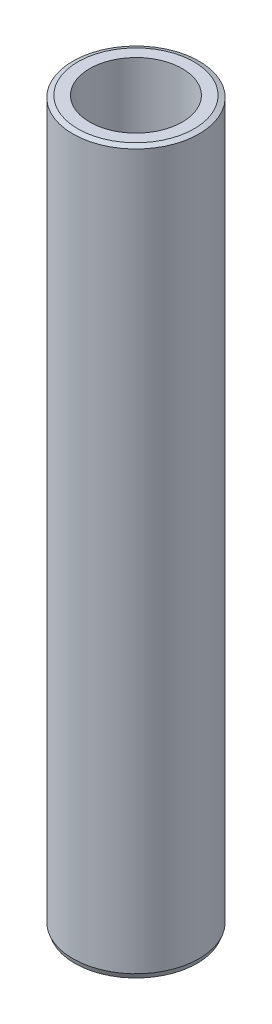
ISO-10303-21;
HEADER;
FILE_DESCRIPTION(('STEP AP214'),'2;1');
FILE_NAME('part.step','',(''),(''),'','','');
FILE_SCHEMA(('AUTOMOTIVE_DESIGN { 1 0 10303 214 1 1 1 1 }'));
ENDSEC;
DATA;
#1=APPLICATION_CONTEXT('core data for automotive mechanical design processes');
#2=APPLICATION_PROTOCOL_DEFINITION('international standard','automotive_design',2000,#1);
#3=PRODUCT_CONTEXT('',#1,'mechanical');
#4=PRODUCT('Part','Part','',(#3));
#5=PRODUCT_RELATED_PRODUCT_CATEGORY('part','',(#4));
#6=PRODUCT_DEFINITION_FORMATION('','',#4);
#7=PRODUCT_DEFINITION_CONTEXT('part definition',#1,'design');
#8=PRODUCT_DEFINITION('design','',#6,#7);
#9=PRODUCT_DEFINITION_SHAPE('','',#8);
#10=(LENGTH_UNIT() NAMED_UNIT(*) SI_UNIT(.MILLI.,.METRE.));
#11=(NAMED_UNIT(*) PLANE_ANGLE_UNIT() SI_UNIT($,.RADIAN.));
#12=(NAMED_UNIT(*) SI_UNIT($,.STERADIAN.) SOLID_ANGLE_UNIT());
#13=UNCERTAINTY_MEASURE_WITH_UNIT(LENGTH_MEASURE(1.E-05),#10,'distance_accuracy_value','');
#14=(GEOMETRIC_REPRESENTATION_CONTEXT(3) GLOBAL_UNCERTAINTY_ASSIGNED_CONTEXT((#13)) GLOBAL_UNIT_ASSIGNED_CONTEXT((#10,
#11,#12)) REPRESENTATION_CONTEXT('',''));
#15=CARTESIAN_POINT('',(0.,0.,0.));
#16=DIRECTION('',(0.,0.,1.));
#17=DIRECTION('',(1.,0.,0.));
#18=AXIS2_PLACEMENT_3D('',#15,#16,#17);
#19=CARTESIAN_POINT('',(0.,600.,0.));
#20=DIRECTION('',(0.,-1.,0.));
#21=DIRECTION('',(0.,0.,-1.));
#22=AXIS2_PLACEMENT_3D('',#19,#20,#21);
#23=CYLINDRICAL_SURFACE('',#22,52.5);
#24=CARTESIAN_POINT('',(0.,598.425956598295,0.));
#25=DIRECTION('',(0.,1.,0.));
#26=DIRECTION('',(0.,0.,1.));
#27=AXIS2_PLACEMENT_3D('',#24,#25,#26);
#28=CIRCLE('',#27,52.5);
#29=CARTESIAN_POINT('',(0.,598.425956598295,52.5));
#30=VERTEX_POINT('',#29);
#31=EDGE_CURVE('E50',#30,#30,#28,.F.);
#32=ORIENTED_EDGE('',*,*,#31,.T.);
#33=EDGE_LOOP('',(#32));
#34=FACE_BOUND('',#33,.T.);
#35=CARTESIAN_POINT('',(0.,4.16224040522351,0.));
#36=DIRECTION('',(0.,1.,0.));
#37=DIRECTION('',(0.,0.,1.));
#38=AXIS2_PLACEMENT_3D('',#35,#36,#37);
#39=CIRCLE('',#38,52.5);
#40=CARTESIAN_POINT('',(0.,4.16224040522351,52.5));
#41=VERTEX_POINT('',#40);
#42=EDGE_CURVE('E51',#41,#41,#39,.T.);
#43=ORIENTED_EDGE('',*,*,#42,.T.);
#44=EDGE_LOOP('',(#43));
#45=FACE_BOUND('',#44,.T.);
#46=ADVANCED_FACE('F39',(#34,#45),#23,.T.);
#47=CARTESIAN_POINT('',(0.,600.,0.));
#48=DIRECTION('',(0.,1.,0.));
#49=DIRECTION('',(0.,0.,1.));
#50=AXIS2_PLACEMENT_3D('',#47,#48,#49);
#51=PLANE('',#50);
#52=CARTESIAN_POINT('',(0.,600.,0.));
#53=DIRECTION('',(0.,1.,0.));
#54=DIRECTION('',(0.,0.,1.));
#55=AXIS2_PLACEMENT_3D('',#52,#53,#54);
#56=CIRCLE('',#55,48.3377595947759);
#57=CARTESIAN_POINT('',(0.,600.,48.3377595947759));
#58=VERTEX_POINT('',#57);
#59=EDGE_CURVE('E54',#58,#58,#56,.T.);
#60=ORIENTED_EDGE('',*,*,#59,.T.);
#61=EDGE_LOOP('',(#60));
#62=FACE_BOUND('',#61,.T.);
#63=CARTESIAN_POINT('',(0.,600.,0.));
#64=DIRECTION('',(0.,1.,0.));
#65=DIRECTION('',(0.,0.,1.));
#66=AXIS2_PLACEMENT_3D('',#63,#64,#65);
#67=CIRCLE('',#66,38.5579078382084);
#68=CARTESIAN_POINT('',(0.,600.,38.5579078382084));
#69=VERTEX_POINT('',#68);
#70=EDGE_CURVE('E58',#69,#69,#67,.T.);
#71=ORIENTED_EDGE('',*,*,#70,.F.);
#72=EDGE_LOOP('',(#71));
#73=FACE_BOUND('',#72,.T.);
#74=ADVANCED_FACE('F69',(#62,#73),#51,.T.);
#75=CARTESIAN_POINT('',(0.,0.,0.));
#76=DIRECTION('',(0.,1.,0.));
#77=DIRECTION('',(0.,0.,1.));
#78=AXIS2_PLACEMENT_3D('',#75,#76,#77);
#79=PLANE('',#78);
#80=CARTESIAN_POINT('',(0.,0.,0.));
#81=DIRECTION('',(0.,1.,0.));
#82=DIRECTION('',(0.,0.,1.));
#83=AXIS2_PLACEMENT_3D('',#80,#81,#82);
#84=CIRCLE('',#83,50.9259565982952);
#85=CARTESIAN_POINT('',(0.,0.,50.9259565982952));
#86=VERTEX_POINT('',#85);
#87=EDGE_CURVE('E10',#86,#86,#84,.F.);
#88=ORIENTED_EDGE('',*,*,#87,.T.);
#89=EDGE_LOOP('',(#88));
#90=FACE_BOUND('',#89,.T.);
#91=CARTESIAN_POINT('',(0.,0.,0.));
#92=DIRECTION('',(0.,1.,0.));
#93=DIRECTION('',(0.,0.,1.));
#94=AXIS2_PLACEMENT_3D('',#91,#92,#93);
#95=CIRCLE('',#94,38.5579078382084);
#96=CARTESIAN_POINT('',(0.,0.,38.5579078382084));
#97=VERTEX_POINT('',#96);
#98=EDGE_CURVE('E63',#97,#97,#95,.T.);
#99=ORIENTED_EDGE('',*,*,#98,.T.);
#100=EDGE_LOOP('',(#99));
#101=FACE_BOUND('',#100,.T.);
#102=ADVANCED_FACE('F75',(#90,#101),#79,.F.);
#103=CARTESIAN_POINT('',(0.,600.,0.));
#104=DIRECTION('',(0.,-1.,0.));
#105=DIRECTION('',(0.,0.,-1.));
#106=AXIS2_PLACEMENT_3D('',#103,#104,#105);
#107=CYLINDRICAL_SURFACE('',#106,38.5579078382084);
#108=ORIENTED_EDGE('',*,*,#70,.T.);
#109=EDGE_LOOP('',(#108));
#110=FACE_BOUND('',#109,.T.);
#111=ORIENTED_EDGE('',*,*,#98,.F.);
#112=EDGE_LOOP('',(#111));
#113=FACE_BOUND('',#112,.T.);
#114=ADVANCED_FACE('F70',(#110,#113),#107,.F.);
#115=CARTESIAN_POINT('',(0.,600.,0.));
#116=DIRECTION('',(0.,-1.,0.));
#117=DIRECTION('',(0.,0.,-1.));
#118=AXIS2_PLACEMENT_3D('',#115,#116,#117);
#119=CONICAL_SURFACE('',#118,48.3377595947759,1.20924749824612);
#120=ORIENTED_EDGE('',*,*,#31,.F.);
#121=EDGE_LOOP('',(#120));
#122=FACE_BOUND('',#121,.T.);
#123=ORIENTED_EDGE('',*,*,#59,.F.);
#124=EDGE_LOOP('',(#123));
#125=FACE_BOUND('',#124,.T.);
#126=ADVANCED_FACE('F81',(#122,#125),#119,.T.);
#127=CARTESIAN_POINT('',(0.,4.16224040522351,0.));
#128=DIRECTION('',(0.,1.,0.));
#129=DIRECTION('',(0.,0.,1.));
#130=AXIS2_PLACEMENT_3D('',#127,#128,#129);
#131=CONICAL_SURFACE('',#130,52.5,0.361548828548779);
#132=ORIENTED_EDGE('',*,*,#87,.F.);
#133=EDGE_LOOP('',(#132));
#134=FACE_BOUND('',#133,.T.);
#135=ORIENTED_EDGE('',*,*,#42,.F.);
#136=EDGE_LOOP('',(#135));
#137=FACE_BOUND('',#136,.T.);
#138=ADVANCED_FACE('F45',(#134,#137),#131,.T.);
#139=CLOSED_SHELL('',(#46,#74,#102,#114,#126,#138));
#140=MANIFOLD_SOLID_BREP('B2',#139);
#141=ADVANCED_BREP_SHAPE_REPRESENTATION('',(#18,#140),#14);
#142=SHAPE_DEFINITION_REPRESENTATION(#9,#141);
ENDSEC;
END-ISO-10303-21;
